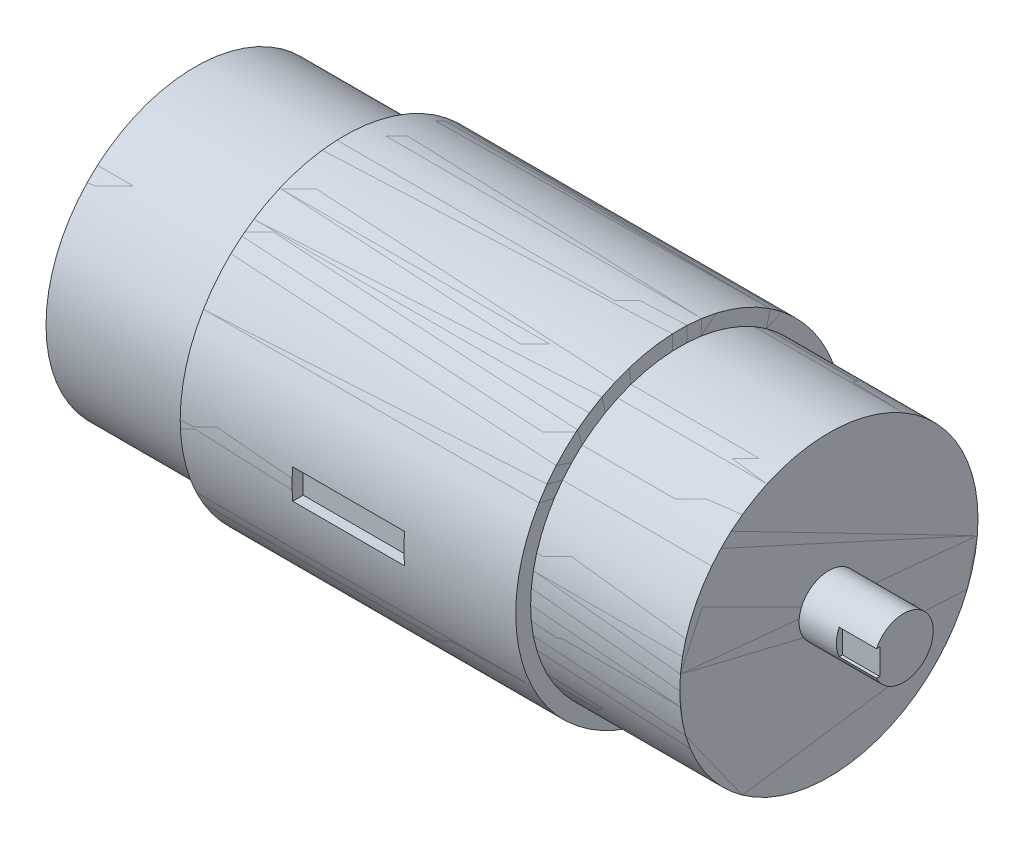
ISO-10303-21;
HEADER;
FILE_DESCRIPTION(('STEP AP214'),'2;1');
FILE_NAME('part.step','',(''),(''),'','','');
FILE_SCHEMA(('AUTOMOTIVE_DESIGN { 1 0 10303 214 1 1 1 1 }'));
ENDSEC;
DATA;
#1=APPLICATION_CONTEXT('core data for automotive mechanical design processes');
#2=APPLICATION_PROTOCOL_DEFINITION('international standard','automotive_design',2000,#1);
#3=PRODUCT_CONTEXT('',#1,'mechanical');
#4=PRODUCT('Part','Part','',(#3));
#5=PRODUCT_RELATED_PRODUCT_CATEGORY('part','',(#4));
#6=PRODUCT_DEFINITION_FORMATION('','',#4);
#7=PRODUCT_DEFINITION_CONTEXT('part definition',#1,'design');
#8=PRODUCT_DEFINITION('design','',#6,#7);
#9=PRODUCT_DEFINITION_SHAPE('','',#8);
#10=(LENGTH_UNIT() NAMED_UNIT(*) SI_UNIT(.MILLI.,.METRE.));
#11=(NAMED_UNIT(*) PLANE_ANGLE_UNIT() SI_UNIT($,.RADIAN.));
#12=(NAMED_UNIT(*) SI_UNIT($,.STERADIAN.) SOLID_ANGLE_UNIT());
#13=UNCERTAINTY_MEASURE_WITH_UNIT(LENGTH_MEASURE(1.E-05),#10,'distance_accuracy_value','');
#14=(GEOMETRIC_REPRESENTATION_CONTEXT(3) GLOBAL_UNCERTAINTY_ASSIGNED_CONTEXT((#13)) GLOBAL_UNIT_ASSIGNED_CONTEXT((#10,
#11,#12)) REPRESENTATION_CONTEXT('',''));
#15=CARTESIAN_POINT('',(0.,0.,0.));
#16=DIRECTION('',(0.,0.,1.));
#17=DIRECTION('',(1.,0.,0.));
#18=AXIS2_PLACEMENT_3D('',#15,#16,#17);
#19=CARTESIAN_POINT('',(150.,0.,0.));
#20=DIRECTION('',(1.,0.,0.));
#21=DIRECTION('',(0.,0.,-1.));
#22=AXIS2_PLACEMENT_3D('',#19,#20,#21);
#23=CYLINDRICAL_SURFACE('',#22,220.);
#24=CARTESIAN_POINT('',(450.,0.,0.));
#25=DIRECTION('',(1.,0.,0.));
#26=DIRECTION('',(0.,0.,-1.));
#27=AXIS2_PLACEMENT_3D('',#24,#25,#26);
#28=CIRCLE('',#27,220.);
#29=CARTESIAN_POINT('',(450.,-20.,219.089023002066));
#30=VERTEX_POINT('',#29);
#31=CARTESIAN_POINT('',(450.,20.,219.089023002066));
#32=VERTEX_POINT('',#31);
#33=EDGE_CURVE('E61',#30,#32,#28,.F.);
#34=ORIENTED_EDGE('',*,*,#33,.F.);
#35=DIRECTION('',(1.,0.,0.));
#36=VECTOR('',#35,1.);
#37=CARTESIAN_POINT('',(150.,-20.,219.089023002066));
#38=LINE('',#37,#36);
#39=CARTESIAN_POINT('',(300.,-20.,219.089023002066));
#40=VERTEX_POINT('',#39);
#41=EDGE_CURVE('E51',#40,#30,#38,.T.);
#42=ORIENTED_EDGE('',*,*,#41,.F.);
#43=CARTESIAN_POINT('',(300.,0.,0.));
#44=DIRECTION('',(1.,0.,0.));
#45=DIRECTION('',(0.,0.,-1.));
#46=AXIS2_PLACEMENT_3D('',#43,#44,#45);
#47=CIRCLE('',#46,220.);
#48=CARTESIAN_POINT('',(300.,20.,219.089023002066));
#49=VERTEX_POINT('',#48);
#50=EDGE_CURVE('E12',#40,#49,#47,.F.);
#51=ORIENTED_EDGE('',*,*,#50,.T.);
#52=DIRECTION('',(1.,0.,0.));
#53=VECTOR('',#52,1.);
#54=CARTESIAN_POINT('',(150.,20.,219.089023002066));
#55=LINE('',#54,#53);
#56=EDGE_CURVE('E80',#49,#32,#55,.T.);
#57=ORIENTED_EDGE('',*,*,#56,.T.);
#58=EDGE_LOOP('',(#34,#42,#51,#57));
#59=FACE_BOUND('',#58,.T.);
#60=CARTESIAN_POINT('',(600.,0.,0.));
#61=DIRECTION('',(1.,0.,0.));
#62=DIRECTION('',(0.,0.,-1.));
#63=AXIS2_PLACEMENT_3D('',#60,#61,#62);
#64=CIRCLE('',#63,220.);
#65=CARTESIAN_POINT('',(600.,0.,-220.));
#66=VERTEX_POINT('',#65);
#67=EDGE_CURVE('E82',#66,#66,#64,.T.);
#68=ORIENTED_EDGE('',*,*,#67,.F.);
#69=EDGE_LOOP('',(#68));
#70=FACE_BOUND('',#69,.T.);
#71=CARTESIAN_POINT('',(150.,0.,0.));
#72=DIRECTION('',(1.,0.,0.));
#73=DIRECTION('',(0.,0.,-1.));
#74=AXIS2_PLACEMENT_3D('',#71,#72,#73);
#75=CIRCLE('',#74,220.);
#76=CARTESIAN_POINT('',(150.,0.,-220.));
#77=VERTEX_POINT('',#76);
#78=EDGE_CURVE('E111',#77,#77,#75,.T.);
#79=ORIENTED_EDGE('',*,*,#78,.T.);
#80=EDGE_LOOP('',(#79));
#81=FACE_BOUND('',#80,.T.);
#82=ADVANCED_FACE('F45',(#59,#70,#81),#23,.T.);
#83=CARTESIAN_POINT('',(300.,20.,205.));
#84=DIRECTION('',(0.,-1.,0.));
#85=DIRECTION('',(0.,0.,-1.));
#86=AXIS2_PLACEMENT_3D('',#83,#84,#85);
#87=PLANE('',#86);
#88=DIRECTION('',(0.,0.,1.));
#89=VECTOR('',#88,1.);
#90=CARTESIAN_POINT('',(300.,20.,205.));
#91=LINE('',#90,#89);
#92=CARTESIAN_POINT('',(300.,20.,205.));
#93=VERTEX_POINT('',#92);
#94=EDGE_CURVE('E75',#93,#49,#91,.T.);
#95=ORIENTED_EDGE('',*,*,#94,.F.);
#96=DIRECTION('',(1.,0.,0.));
#97=VECTOR('',#96,1.);
#98=CARTESIAN_POINT('',(300.,20.,205.));
#99=LINE('',#98,#97);
#100=CARTESIAN_POINT('',(450.,20.,205.));
#101=VERTEX_POINT('',#100);
#102=EDGE_CURVE('E78',#93,#101,#99,.T.);
#103=ORIENTED_EDGE('',*,*,#102,.T.);
#104=DIRECTION('',(0.,0.,1.));
#105=VECTOR('',#104,1.);
#106=CARTESIAN_POINT('',(450.,20.,205.));
#107=LINE('',#106,#105);
#108=EDGE_CURVE('E85',#101,#32,#107,.T.);
#109=ORIENTED_EDGE('',*,*,#108,.T.);
#110=ORIENTED_EDGE('',*,*,#56,.F.);
#111=EDGE_LOOP('',(#95,#103,#109,#110));
#112=FACE_BOUND('',#111,.T.);
#113=ADVANCED_FACE('F77',(#112),#87,.T.);
#114=CARTESIAN_POINT('',(600.,0.,0.));
#115=DIRECTION('',(1.,0.,0.));
#116=DIRECTION('',(0.,0.,-1.));
#117=AXIS2_PLACEMENT_3D('',#114,#115,#116);
#118=PLANE('',#117);
#119=CARTESIAN_POINT('',(600.,0.,0.));
#120=DIRECTION('',(1.,0.,0.));
#121=DIRECTION('',(0.,0.,-1.));
#122=AXIS2_PLACEMENT_3D('',#119,#120,#121);
#123=CIRCLE('',#122,200.);
#124=CARTESIAN_POINT('',(600.,0.,-200.));
#125=VERTEX_POINT('',#124);
#126=EDGE_CURVE('E156',#125,#125,#123,.F.);
#127=ORIENTED_EDGE('',*,*,#126,.T.);
#128=EDGE_LOOP('',(#127));
#129=FACE_BOUND('',#128,.T.);
#130=ORIENTED_EDGE('',*,*,#67,.T.);
#131=EDGE_LOOP('',(#130));
#132=FACE_BOUND('',#131,.T.);
#133=ADVANCED_FACE('F123',(#129,#132),#118,.T.);
#134=CARTESIAN_POINT('',(800.,0.,0.));
#135=DIRECTION('',(1.,0.,0.));
#136=DIRECTION('',(0.,0.,-1.));
#137=AXIS2_PLACEMENT_3D('',#134,#135,#136);
#138=PLANE('',#137);
#139=CARTESIAN_POINT('',(800.,0.,0.));
#140=DIRECTION('',(1.,0.,0.));
#141=DIRECTION('',(0.,0.,-1.));
#142=AXIS2_PLACEMENT_3D('',#139,#140,#141);
#143=CIRCLE('',#142,200.);
#144=CARTESIAN_POINT('',(800.,0.,-200.));
#145=VERTEX_POINT('',#144);
#146=EDGE_CURVE('E119',#145,#145,#143,.T.);
#147=ORIENTED_EDGE('',*,*,#146,.T.);
#148=EDGE_LOOP('',(#147));
#149=FACE_BOUND('',#148,.T.);
#150=ADVANCED_FACE('F125',(#149),#138,.T.);
#151=CARTESIAN_POINT('',(-49.9999999999999,0.,0.));
#152=DIRECTION('',(1.,0.,0.));
#153=DIRECTION('',(0.,0.,-1.));
#154=AXIS2_PLACEMENT_3D('',#151,#152,#153);
#155=CYLINDRICAL_SURFACE('',#154,200.);
#156=CARTESIAN_POINT('',(-49.9999999999999,0.,0.));
#157=DIRECTION('',(-1.,0.,0.));
#158=DIRECTION('',(0.,0.,1.));
#159=AXIS2_PLACEMENT_3D('',#156,#157,#158);
#160=CIRCLE('',#159,200.);
#161=CARTESIAN_POINT('',(-49.9999999999999,0.,200.));
#162=VERTEX_POINT('',#161);
#163=EDGE_CURVE('E114',#162,#162,#160,.T.);
#164=ORIENTED_EDGE('',*,*,#163,.F.);
#165=EDGE_LOOP('',(#164));
#166=FACE_BOUND('',#165,.T.);
#167=CARTESIAN_POINT('',(150.,0.,0.));
#168=DIRECTION('',(1.,0.,0.));
#169=DIRECTION('',(0.,0.,-1.));
#170=AXIS2_PLACEMENT_3D('',#167,#168,#169);
#171=CIRCLE('',#170,200.);
#172=CARTESIAN_POINT('',(150.,0.,-200.));
#173=VERTEX_POINT('',#172);
#174=EDGE_CURVE('E113',#173,#173,#171,.F.);
#175=ORIENTED_EDGE('',*,*,#174,.T.);
#176=EDGE_LOOP('',(#175));
#177=FACE_BOUND('',#176,.T.);
#178=ADVANCED_FACE('F133',(#166,#177),#155,.T.);
#179=CARTESIAN_POINT('',(150.,0.,0.));
#180=DIRECTION('',(1.,0.,0.));
#181=DIRECTION('',(0.,0.,-1.));
#182=AXIS2_PLACEMENT_3D('',#179,#180,#181);
#183=PLANE('',#182);
#184=ORIENTED_EDGE('',*,*,#78,.F.);
#185=EDGE_LOOP('',(#184));
#186=FACE_BOUND('',#185,.T.);
#187=ORIENTED_EDGE('',*,*,#174,.F.);
#188=EDGE_LOOP('',(#187));
#189=FACE_BOUND('',#188,.T.);
#190=ADVANCED_FACE('F140',(#186,#189),#183,.F.);
#191=CARTESIAN_POINT('',(-49.9999999999999,0.,0.));
#192=DIRECTION('',(-1.,0.,0.));
#193=DIRECTION('',(0.,0.,1.));
#194=AXIS2_PLACEMENT_3D('',#191,#192,#193);
#195=PLANE('',#194);
#196=ORIENTED_EDGE('',*,*,#163,.T.);
#197=EDGE_LOOP('',(#196));
#198=FACE_BOUND('',#197,.T.);
#199=ADVANCED_FACE('F144',(#198),#195,.T.);
#200=CARTESIAN_POINT('',(600.,0.,0.));
#201=DIRECTION('',(1.,0.,0.));
#202=DIRECTION('',(0.,0.,-1.));
#203=AXIS2_PLACEMENT_3D('',#200,#201,#202);
#204=CYLINDRICAL_SURFACE('',#203,200.);
#205=ORIENTED_EDGE('',*,*,#126,.F.);
#206=EDGE_LOOP('',(#205));
#207=FACE_BOUND('',#206,.T.);
#208=ORIENTED_EDGE('',*,*,#146,.F.);
#209=EDGE_LOOP('',(#208));
#210=FACE_BOUND('',#209,.T.);
#211=ADVANCED_FACE('F147',(#207,#210),#204,.T.);
#212=OPEN_SHELL('',(#82,#113,#133,#150,#178,#190,#199,#211));
#213=SHELL_BASED_SURFACE_MODEL('B2',(#212));
#214=CARTESIAN_POINT('',(900.,0.,0.));
#215=DIRECTION('',(-1.,0.,0.));
#216=DIRECTION('',(0.,0.,1.));
#217=AXIS2_PLACEMENT_3D('',#214,#215,#216);
#218=CYLINDRICAL_SURFACE('',#217,40.);
#219=CARTESIAN_POINT('',(900.,0.,0.));
#220=DIRECTION('',(1.,0.,0.));
#221=DIRECTION('',(0.,0.,-1.));
#222=AXIS2_PLACEMENT_3D('',#219,#220,#221);
#223=CIRCLE('',#222,40.);
#224=CARTESIAN_POINT('',(900.,-17.1859822942751,36.1198285236913));
#225=VERTEX_POINT('',#224);
#226=CARTESIAN_POINT('',(900.,17.1859822942751,36.1198285236913));
#227=VERTEX_POINT('',#226);
#228=EDGE_CURVE('E43',#225,#227,#223,.T.);
#229=ORIENTED_EDGE('',*,*,#228,.F.);
#230=DIRECTION('',(1.,0.,0.));
#231=VECTOR('',#230,1.);
#232=CARTESIAN_POINT('',(850.,-17.1859822942751,36.1198285236913));
#233=LINE('',#232,#231);
#234=CARTESIAN_POINT('',(850.,-17.1859822942751,36.1198285236913));
#235=VERTEX_POINT('',#234);
#236=EDGE_CURVE('E271',#235,#225,#233,.T.);
#237=ORIENTED_EDGE('',*,*,#236,.F.);
#238=CARTESIAN_POINT('',(850.,0.,0.));
#239=DIRECTION('',(1.,0.,0.));
#240=DIRECTION('',(0.,0.,-1.));
#241=AXIS2_PLACEMENT_3D('',#238,#239,#240);
#242=CIRCLE('',#241,40.);
#243=CARTESIAN_POINT('',(850.,17.1859822942751,36.1198285236913));
#244=VERTEX_POINT('',#243);
#245=EDGE_CURVE('E276',#244,#235,#242,.T.);
#246=ORIENTED_EDGE('',*,*,#245,.F.);
#247=DIRECTION('',(1.,0.,0.));
#248=VECTOR('',#247,1.);
#249=CARTESIAN_POINT('',(850.,17.1859822942751,36.1198285236913));
#250=LINE('',#249,#248);
#251=EDGE_CURVE('E261',#244,#227,#250,.T.);
#252=ORIENTED_EDGE('',*,*,#251,.T.);
#253=EDGE_LOOP('',(#229,#237,#246,#252));
#254=FACE_BOUND('',#253,.T.);
#255=CARTESIAN_POINT('',(800.,0.,0.));
#256=DIRECTION('',(1.,0.,0.));
#257=DIRECTION('',(0.,0.,-1.));
#258=AXIS2_PLACEMENT_3D('',#255,#256,#257);
#259=CIRCLE('',#258,40.);
#260=CARTESIAN_POINT('',(800.,0.,-40.));
#261=VERTEX_POINT('',#260);
#262=EDGE_CURVE('E222',#261,#261,#259,.T.);
#263=ORIENTED_EDGE('',*,*,#262,.T.);
#264=EDGE_LOOP('',(#263));
#265=FACE_BOUND('',#264,.T.);
#266=ADVANCED_FACE('F219',(#254,#265),#218,.T.);
#267=CARTESIAN_POINT('',(900.,0.,0.));
#268=DIRECTION('',(1.,0.,0.));
#269=DIRECTION('',(0.,0.,-1.));
#270=AXIS2_PLACEMENT_3D('',#267,#268,#269);
#271=PLANE('',#270);
#272=DIRECTION('',(0.,0.,-1.));
#273=VECTOR('',#272,1.);
#274=CARTESIAN_POINT('',(900.,-17.1859822942751,31.7092830153853));
#275=LINE('',#274,#273);
#276=CARTESIAN_POINT('',(900.,-17.1859822942751,31.7092830153853));
#277=VERTEX_POINT('',#276);
#278=EDGE_CURVE('E288',#225,#277,#275,.T.);
#279=ORIENTED_EDGE('',*,*,#278,.F.);
#280=ORIENTED_EDGE('',*,*,#228,.T.);
#281=DIRECTION('',(0.,0.,1.));
#282=VECTOR('',#281,1.);
#283=CARTESIAN_POINT('',(900.,17.1859822942751,36.1198285236913));
#284=LINE('',#283,#282);
#285=CARTESIAN_POINT('',(900.,17.1859822942751,31.7092830153853));
#286=VERTEX_POINT('',#285);
#287=EDGE_CURVE('E267',#286,#227,#284,.T.);
#288=ORIENTED_EDGE('',*,*,#287,.F.);
#289=DIRECTION('',(0.,1.,0.));
#290=VECTOR('',#289,1.);
#291=CARTESIAN_POINT('',(900.,17.1859822942751,31.7092830153853));
#292=LINE('',#291,#290);
#293=EDGE_CURVE('E233',#277,#286,#292,.T.);
#294=ORIENTED_EDGE('',*,*,#293,.F.);
#295=EDGE_LOOP('',(#279,#280,#288,#294));
#296=FACE_BOUND('',#295,.T.);
#297=ADVANCED_FACE('F294',(#296),#271,.T.);
#298=CARTESIAN_POINT('',(800.,0.,0.));
#299=DIRECTION('',(1.,0.,0.));
#300=DIRECTION('',(0.,0.,-1.));
#301=AXIS2_PLACEMENT_3D('',#298,#299,#300);
#302=PLANE('',#301);
#303=ORIENTED_EDGE('',*,*,#262,.F.);
#304=EDGE_LOOP('',(#303));
#305=FACE_BOUND('',#304,.T.);
#306=ADVANCED_FACE('F304',(#305),#302,.F.);
#307=CARTESIAN_POINT('',(850.,17.1859822942751,31.7092830153853));
#308=DIRECTION('',(0.,0.,-1.));
#309=DIRECTION('',(0.,1.,0.));
#310=AXIS2_PLACEMENT_3D('',#307,#308,#309);
#311=PLANE('',#310);
#312=ORIENTED_EDGE('',*,*,#293,.T.);
#313=DIRECTION('',(1.,0.,0.));
#314=VECTOR('',#313,1.);
#315=CARTESIAN_POINT('',(850.,17.1859822942751,31.7092830153853));
#316=LINE('',#315,#314);
#317=CARTESIAN_POINT('',(850.,17.1859822942751,31.7092830153853));
#318=VERTEX_POINT('',#317);
#319=EDGE_CURVE('E256',#318,#286,#316,.T.);
#320=ORIENTED_EDGE('',*,*,#319,.F.);
#321=DIRECTION('',(0.,1.,0.));
#322=VECTOR('',#321,1.);
#323=CARTESIAN_POINT('',(850.,17.1859822942751,31.7092830153853));
#324=LINE('',#323,#322);
#325=CARTESIAN_POINT('',(850.,-17.1859822942751,31.7092830153853));
#326=VERTEX_POINT('',#325);
#327=EDGE_CURVE('E277',#326,#318,#324,.T.);
#328=ORIENTED_EDGE('',*,*,#327,.F.);
#329=DIRECTION('',(1.,0.,0.));
#330=VECTOR('',#329,1.);
#331=CARTESIAN_POINT('',(850.,-17.1859822942751,31.7092830153853));
#332=LINE('',#331,#330);
#333=EDGE_CURVE('E241',#326,#277,#332,.T.);
#334=ORIENTED_EDGE('',*,*,#333,.T.);
#335=EDGE_LOOP('',(#312,#320,#328,#334));
#336=FACE_BOUND('',#335,.T.);
#337=ADVANCED_FACE('F297',(#336),#311,.F.);
#338=CARTESIAN_POINT('',(850.,-17.1859822942751,31.7092830153853));
#339=DIRECTION('',(0.,-1.,0.));
#340=DIRECTION('',(0.,0.,-1.));
#341=AXIS2_PLACEMENT_3D('',#338,#339,#340);
#342=PLANE('',#341);
#343=ORIENTED_EDGE('',*,*,#278,.T.);
#344=ORIENTED_EDGE('',*,*,#333,.F.);
#345=DIRECTION('',(0.,0.,-1.));
#346=VECTOR('',#345,1.);
#347=CARTESIAN_POINT('',(850.,-17.1859822942751,31.7092830153853));
#348=LINE('',#347,#346);
#349=EDGE_CURVE('E281',#235,#326,#348,.T.);
#350=ORIENTED_EDGE('',*,*,#349,.F.);
#351=ORIENTED_EDGE('',*,*,#236,.T.);
#352=EDGE_LOOP('',(#343,#344,#350,#351));
#353=FACE_BOUND('',#352,.T.);
#354=ADVANCED_FACE('F295',(#353),#342,.F.);
#355=CARTESIAN_POINT('',(850.,17.1859822942751,36.1198285236913));
#356=DIRECTION('',(0.,1.,0.));
#357=DIRECTION('',(0.,0.,1.));
#358=AXIS2_PLACEMENT_3D('',#355,#356,#357);
#359=PLANE('',#358);
#360=ORIENTED_EDGE('',*,*,#287,.T.);
#361=ORIENTED_EDGE('',*,*,#251,.F.);
#362=DIRECTION('',(0.,0.,1.));
#363=VECTOR('',#362,1.);
#364=CARTESIAN_POINT('',(850.,17.1859822942751,36.1198285236913));
#365=LINE('',#364,#363);
#366=EDGE_CURVE('E264',#318,#244,#365,.T.);
#367=ORIENTED_EDGE('',*,*,#366,.F.);
#368=ORIENTED_EDGE('',*,*,#319,.T.);
#369=EDGE_LOOP('',(#360,#361,#367,#368));
#370=FACE_BOUND('',#369,.T.);
#371=ADVANCED_FACE('F263',(#370),#359,.F.);
#372=CARTESIAN_POINT('',(850.,0.,0.));
#373=DIRECTION('',(1.,0.,0.));
#374=DIRECTION('',(0.,0.,-1.));
#375=AXIS2_PLACEMENT_3D('',#372,#373,#374);
#376=PLANE('',#375);
#377=ORIENTED_EDGE('',*,*,#327,.T.);
#378=ORIENTED_EDGE('',*,*,#366,.T.);
#379=ORIENTED_EDGE('',*,*,#245,.T.);
#380=ORIENTED_EDGE('',*,*,#349,.T.);
#381=EDGE_LOOP('',(#377,#378,#379,#380));
#382=FACE_BOUND('',#381,.T.);
#383=ADVANCED_FACE('F274',(#382),#376,.T.);
#384=CLOSED_SHELL('',(#266,#297,#306,#337,#354,#371,#383));
#385=MANIFOLD_SOLID_BREP('B6',#384);
#386=CARTESIAN_POINT('',(150.,0.,0.));
#387=DIRECTION('',(1.,0.,0.));
#388=DIRECTION('',(0.,0.,-1.));
#389=AXIS2_PLACEMENT_3D('',#386,#387,#388);
#390=CYLINDRICAL_SURFACE('',#389,220.);
#391=CARTESIAN_POINT('',(450.,0.,0.));
#392=DIRECTION('',(1.,0.,0.));
#393=DIRECTION('',(0.,0.,-1.));
#394=AXIS2_PLACEMENT_3D('',#391,#392,#393);
#395=CIRCLE('',#394,220.);
#396=CARTESIAN_POINT('',(450.,-20.,219.089023002066));
#397=VERTEX_POINT('',#396);
#398=CARTESIAN_POINT('',(450.,20.,219.089023002066));
#399=VERTEX_POINT('',#398);
#400=EDGE_CURVE('E438',#397,#399,#395,.F.);
#401=ORIENTED_EDGE('',*,*,#400,.F.);
#402=DIRECTION('',(1.,0.,0.));
#403=VECTOR('',#402,1.);
#404=CARTESIAN_POINT('',(150.,-20.,219.089023002066));
#405=LINE('',#404,#403);
#406=CARTESIAN_POINT('',(300.,-20.,219.089023002066));
#407=VERTEX_POINT('',#406);
#408=EDGE_CURVE('E217',#407,#397,#405,.T.);
#409=ORIENTED_EDGE('',*,*,#408,.F.);
#410=CARTESIAN_POINT('',(300.,0.,0.));
#411=DIRECTION('',(1.,0.,0.));
#412=DIRECTION('',(0.,0.,-1.));
#413=AXIS2_PLACEMENT_3D('',#410,#411,#412);
#414=CIRCLE('',#413,220.);
#415=CARTESIAN_POINT('',(300.,20.,219.089023002066));
#416=VERTEX_POINT('',#415);
#417=EDGE_CURVE('E365',#407,#416,#414,.F.);
#418=ORIENTED_EDGE('',*,*,#417,.T.);
#419=DIRECTION('',(1.,0.,0.));
#420=VECTOR('',#419,1.);
#421=CARTESIAN_POINT('',(150.,20.,219.089023002066));
#422=LINE('',#421,#420);
#423=EDGE_CURVE('E379',#416,#399,#422,.T.);
#424=ORIENTED_EDGE('',*,*,#423,.T.);
#425=EDGE_LOOP('',(#401,#409,#418,#424));
#426=FACE_BOUND('',#425,.T.);
#427=CARTESIAN_POINT('',(600.,0.,0.));
#428=DIRECTION('',(1.,0.,0.));
#429=DIRECTION('',(0.,0.,-1.));
#430=AXIS2_PLACEMENT_3D('',#427,#428,#429);
#431=CIRCLE('',#430,220.);
#432=CARTESIAN_POINT('',(600.,0.,-220.));
#433=VERTEX_POINT('',#432);
#434=EDGE_CURVE('E418',#433,#433,#431,.T.);
#435=ORIENTED_EDGE('',*,*,#434,.F.);
#436=EDGE_LOOP('',(#435));
#437=FACE_BOUND('',#436,.T.);
#438=CARTESIAN_POINT('',(150.,0.,0.));
#439=DIRECTION('',(1.,0.,0.));
#440=DIRECTION('',(0.,0.,-1.));
#441=AXIS2_PLACEMENT_3D('',#438,#439,#440);
#442=CIRCLE('',#441,220.);
#443=CARTESIAN_POINT('',(150.,0.,-220.));
#444=VERTEX_POINT('',#443);
#445=EDGE_CURVE('E424',#444,#444,#442,.T.);
#446=ORIENTED_EDGE('',*,*,#445,.T.);
#447=EDGE_LOOP('',(#446));
#448=FACE_BOUND('',#447,.T.);
#449=ADVANCED_FACE('F357',(#426,#437,#448),#390,.T.);
#450=CARTESIAN_POINT('',(150.,0.,0.));
#451=DIRECTION('',(1.,0.,0.));
#452=DIRECTION('',(0.,0.,-1.));
#453=AXIS2_PLACEMENT_3D('',#450,#451,#452);
#454=PLANE('',#453);
#455=ORIENTED_EDGE('',*,*,#445,.F.);
#456=EDGE_LOOP('',(#455));
#457=FACE_BOUND('',#456,.T.);
#458=CARTESIAN_POINT('',(150.,0.,0.));
#459=DIRECTION('',(1.,0.,0.));
#460=DIRECTION('',(0.,0.,-1.));
#461=AXIS2_PLACEMENT_3D('',#458,#459,#460);
#462=CIRCLE('',#461,200.);
#463=CARTESIAN_POINT('',(150.,0.,-200.));
#464=VERTEX_POINT('',#463);
#465=EDGE_CURVE('E435',#464,#464,#462,.F.);
#466=ORIENTED_EDGE('',*,*,#465,.F.);
#467=EDGE_LOOP('',(#466));
#468=FACE_BOUND('',#467,.T.);
#469=ADVANCED_FACE('F461',(#457,#468),#454,.F.);
#470=CARTESIAN_POINT('',(600.,0.,0.));
#471=DIRECTION('',(1.,0.,0.));
#472=DIRECTION('',(0.,0.,-1.));
#473=AXIS2_PLACEMENT_3D('',#470,#471,#472);
#474=CYLINDRICAL_SURFACE('',#473,200.);
#475=CARTESIAN_POINT('',(600.,0.,0.));
#476=DIRECTION('',(1.,0.,0.));
#477=DIRECTION('',(0.,0.,-1.));
#478=AXIS2_PLACEMENT_3D('',#475,#476,#477);
#479=CIRCLE('',#478,200.);
#480=CARTESIAN_POINT('',(600.,0.,-200.));
#481=VERTEX_POINT('',#480);
#482=EDGE_CURVE('E427',#481,#481,#479,.F.);
#483=ORIENTED_EDGE('',*,*,#482,.F.);
#484=EDGE_LOOP('',(#483));
#485=FACE_BOUND('',#484,.T.);
#486=CARTESIAN_POINT('',(800.,0.,0.));
#487=DIRECTION('',(1.,0.,0.));
#488=DIRECTION('',(0.,0.,-1.));
#489=AXIS2_PLACEMENT_3D('',#486,#487,#488);
#490=CIRCLE('',#489,200.);
#491=CARTESIAN_POINT('',(800.,0.,-200.));
#492=VERTEX_POINT('',#491);
#493=EDGE_CURVE('E432',#492,#492,#490,.T.);
#494=ORIENTED_EDGE('',*,*,#493,.F.);
#495=EDGE_LOOP('',(#494));
#496=FACE_BOUND('',#495,.T.);
#497=ADVANCED_FACE('F359',(#485,#496),#474,.T.);
#498=CARTESIAN_POINT('',(800.,0.,0.));
#499=DIRECTION('',(1.,0.,0.));
#500=DIRECTION('',(0.,0.,-1.));
#501=AXIS2_PLACEMENT_3D('',#498,#499,#500);
#502=PLANE('',#501);
#503=ORIENTED_EDGE('',*,*,#493,.T.);
#504=EDGE_LOOP('',(#503));
#505=FACE_BOUND('',#504,.T.);
#506=ADVANCED_FACE('F470',(#505),#502,.T.);
#507=CARTESIAN_POINT('',(600.,0.,0.));
#508=DIRECTION('',(1.,0.,0.));
#509=DIRECTION('',(0.,0.,-1.));
#510=AXIS2_PLACEMENT_3D('',#507,#508,#509);
#511=PLANE('',#510);
#512=ORIENTED_EDGE('',*,*,#482,.T.);
#513=EDGE_LOOP('',(#512));
#514=FACE_BOUND('',#513,.T.);
#515=ORIENTED_EDGE('',*,*,#434,.T.);
#516=EDGE_LOOP('',(#515));
#517=FACE_BOUND('',#516,.T.);
#518=ADVANCED_FACE('F469',(#514,#517),#511,.T.);
#519=CARTESIAN_POINT('',(-49.9999999999999,0.,0.));
#520=DIRECTION('',(1.,0.,0.));
#521=DIRECTION('',(0.,0.,-1.));
#522=AXIS2_PLACEMENT_3D('',#519,#520,#521);
#523=CYLINDRICAL_SURFACE('',#522,200.);
#524=CARTESIAN_POINT('',(-49.9999999999999,0.,0.));
#525=DIRECTION('',(-1.,0.,0.));
#526=DIRECTION('',(0.,0.,1.));
#527=AXIS2_PLACEMENT_3D('',#524,#525,#526);
#528=CIRCLE('',#527,200.);
#529=CARTESIAN_POINT('',(-49.9999999999999,0.,200.));
#530=VERTEX_POINT('',#529);
#531=EDGE_CURVE('E414',#530,#530,#528,.T.);
#532=ORIENTED_EDGE('',*,*,#531,.F.);
#533=EDGE_LOOP('',(#532));
#534=FACE_BOUND('',#533,.T.);
#535=ORIENTED_EDGE('',*,*,#465,.T.);
#536=EDGE_LOOP('',(#535));
#537=FACE_BOUND('',#536,.T.);
#538=ADVANCED_FACE('F477',(#534,#537),#523,.T.);
#539=CARTESIAN_POINT('',(-49.9999999999999,0.,0.));
#540=DIRECTION('',(-1.,0.,0.));
#541=DIRECTION('',(0.,0.,1.));
#542=AXIS2_PLACEMENT_3D('',#539,#540,#541);
#543=PLANE('',#542);
#544=ORIENTED_EDGE('',*,*,#531,.T.);
#545=EDGE_LOOP('',(#544));
#546=FACE_BOUND('',#545,.T.);
#547=ADVANCED_FACE('F493',(#546),#543,.T.);
#548=CARTESIAN_POINT('',(300.,-20.,205.));
#549=DIRECTION('',(1.,0.,0.));
#550=DIRECTION('',(0.,0.,-1.));
#551=AXIS2_PLACEMENT_3D('',#548,#549,#550);
#552=PLANE('',#551);
#553=DIRECTION('',(0.,0.,1.));
#554=VECTOR('',#553,1.);
#555=CARTESIAN_POINT('',(300.,-20.,205.));
#556=LINE('',#555,#554);
#557=CARTESIAN_POINT('',(300.,-20.,205.));
#558=VERTEX_POINT('',#557);
#559=EDGE_CURVE('E411',#558,#407,#556,.T.);
#560=ORIENTED_EDGE('',*,*,#559,.F.);
#561=DIRECTION('',(0.,1.,0.));
#562=VECTOR('',#561,1.);
#563=CARTESIAN_POINT('',(300.,-20.,205.));
#564=LINE('',#563,#562);
#565=CARTESIAN_POINT('',(300.,20.,205.));
#566=VERTEX_POINT('',#565);
#567=EDGE_CURVE('E403',#558,#566,#564,.T.);
#568=ORIENTED_EDGE('',*,*,#567,.T.);
#569=DIRECTION('',(0.,0.,1.));
#570=VECTOR('',#569,1.);
#571=CARTESIAN_POINT('',(300.,20.,205.));
#572=LINE('',#571,#570);
#573=EDGE_CURVE('E410',#566,#416,#572,.T.);
#574=ORIENTED_EDGE('',*,*,#573,.T.);
#575=ORIENTED_EDGE('',*,*,#417,.F.);
#576=EDGE_LOOP('',(#560,#568,#574,#575));
#577=FACE_BOUND('',#576,.T.);
#578=ADVANCED_FACE('F409',(#577),#552,.T.);
#579=CARTESIAN_POINT('',(300.,20.,205.));
#580=DIRECTION('',(0.,-1.,0.));
#581=DIRECTION('',(0.,0.,-1.));
#582=AXIS2_PLACEMENT_3D('',#579,#580,#581);
#583=PLANE('',#582);
#584=ORIENTED_EDGE('',*,*,#573,.F.);
#585=DIRECTION('',(1.,0.,0.));
#586=VECTOR('',#585,1.);
#587=CARTESIAN_POINT('',(300.,20.,205.));
#588=LINE('',#587,#586);
#589=CARTESIAN_POINT('',(450.,20.,205.));
#590=VERTEX_POINT('',#589);
#591=EDGE_CURVE('E399',#566,#590,#588,.T.);
#592=ORIENTED_EDGE('',*,*,#591,.T.);
#593=DIRECTION('',(0.,0.,1.));
#594=VECTOR('',#593,1.);
#595=CARTESIAN_POINT('',(450.,20.,205.));
#596=LINE('',#595,#594);
#597=EDGE_CURVE('E415',#590,#399,#596,.T.);
#598=ORIENTED_EDGE('',*,*,#597,.T.);
#599=ORIENTED_EDGE('',*,*,#423,.F.);
#600=EDGE_LOOP('',(#584,#592,#598,#599));
#601=FACE_BOUND('',#600,.T.);
#602=ADVANCED_FACE('F413',(#601),#583,.T.);
#603=CARTESIAN_POINT('',(450.,-20.,205.));
#604=DIRECTION('',(1.,0.,0.));
#605=DIRECTION('',(0.,0.,-1.));
#606=AXIS2_PLACEMENT_3D('',#603,#604,#605);
#607=PLANE('',#606);
#608=DIRECTION('',(0.,0.,1.));
#609=VECTOR('',#608,1.);
#610=CARTESIAN_POINT('',(450.,-20.,205.));
#611=LINE('',#610,#609);
#612=CARTESIAN_POINT('',(450.,-20.,205.));
#613=VERTEX_POINT('',#612);
#614=EDGE_CURVE('E420',#613,#397,#611,.T.);
#615=ORIENTED_EDGE('',*,*,#614,.T.);
#616=ORIENTED_EDGE('',*,*,#400,.T.);
#617=ORIENTED_EDGE('',*,*,#597,.F.);
#618=DIRECTION('',(0.,1.,0.));
#619=VECTOR('',#618,1.);
#620=CARTESIAN_POINT('',(450.,-20.,205.));
#621=LINE('',#620,#619);
#622=EDGE_CURVE('E406',#613,#590,#621,.T.);
#623=ORIENTED_EDGE('',*,*,#622,.F.);
#624=EDGE_LOOP('',(#615,#616,#617,#623));
#625=FACE_BOUND('',#624,.T.);
#626=ADVANCED_FACE('F447',(#625),#607,.F.);
#627=CARTESIAN_POINT('',(300.,-20.,205.));
#628=DIRECTION('',(0.,-1.,0.));
#629=DIRECTION('',(0.,0.,-1.));
#630=AXIS2_PLACEMENT_3D('',#627,#628,#629);
#631=PLANE('',#630);
#632=ORIENTED_EDGE('',*,*,#408,.T.);
#633=ORIENTED_EDGE('',*,*,#614,.F.);
#634=DIRECTION('',(1.,0.,0.));
#635=VECTOR('',#634,1.);
#636=CARTESIAN_POINT('',(300.,-20.,205.));
#637=LINE('',#636,#635);
#638=EDGE_CURVE('E448',#558,#613,#637,.T.);
#639=ORIENTED_EDGE('',*,*,#638,.F.);
#640=ORIENTED_EDGE('',*,*,#559,.T.);
#641=EDGE_LOOP('',(#632,#633,#639,#640));
#642=FACE_BOUND('',#641,.T.);
#643=ADVANCED_FACE('F445',(#642),#631,.F.);
#644=CARTESIAN_POINT('',(0.,0.,205.));
#645=DIRECTION('',(0.,0.,-1.));
#646=DIRECTION('',(-1.,0.,0.));
#647=AXIS2_PLACEMENT_3D('',#644,#645,#646);
#648=PLANE('',#647);
#649=ORIENTED_EDGE('',*,*,#567,.F.);
#650=ORIENTED_EDGE('',*,*,#638,.T.);
#651=ORIENTED_EDGE('',*,*,#622,.T.);
#652=ORIENTED_EDGE('',*,*,#591,.F.);
#653=EDGE_LOOP('',(#649,#650,#651,#652));
#654=FACE_BOUND('',#653,.T.);
#655=ADVANCED_FACE('F401',(#654),#648,.F.);
#656=CLOSED_SHELL('',(#449,#469,#497,#506,#518,#538,#547,#578,#602,#626,#643,#655));
#657=MANIFOLD_SOLID_BREP('B37',#656);
#658=ADVANCED_BREP_SHAPE_REPRESENTATION('',(#18,#385,#657),#14);
#659=MANIFOLD_SURFACE_SHAPE_REPRESENTATION('',(#18,#213),#14);
#660=SHAPE_REPRESENTATION('',(#18),#14);
#661=SHAPE_DEFINITION_REPRESENTATION(#9,#660);
#662=SHAPE_REPRESENTATION_RELATIONSHIP('','',#660,#658);
#663=SHAPE_REPRESENTATION_RELATIONSHIP('','',#660,#659);
ENDSEC;
END-ISO-10303-21;
